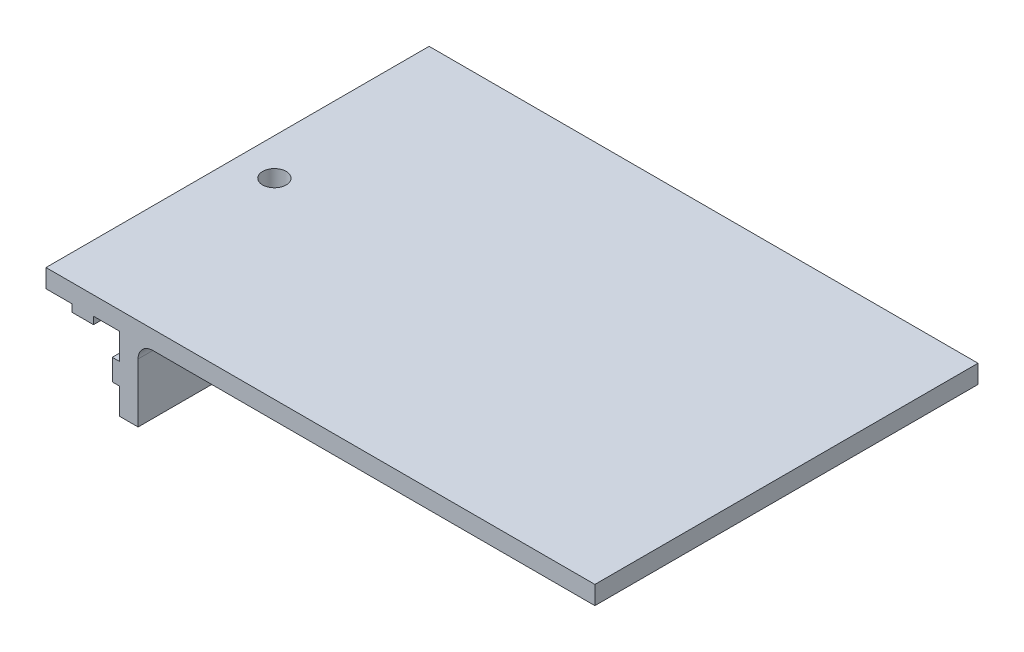
ISO-10303-21;
HEADER;
FILE_DESCRIPTION(('STEP AP214'),'2;1');
FILE_NAME('part.step','',(''),(''),'','','');
FILE_SCHEMA(('AUTOMOTIVE_DESIGN { 1 0 10303 214 1 1 1 1 }'));
ENDSEC;
DATA;
#1=APPLICATION_CONTEXT('core data for automotive mechanical design processes');
#2=APPLICATION_PROTOCOL_DEFINITION('international standard','automotive_design',2000,#1);
#3=PRODUCT_CONTEXT('',#1,'mechanical');
#4=PRODUCT('Part','Part','',(#3));
#5=PRODUCT_RELATED_PRODUCT_CATEGORY('part','',(#4));
#6=PRODUCT_DEFINITION_FORMATION('','',#4);
#7=PRODUCT_DEFINITION_CONTEXT('part definition',#1,'design');
#8=PRODUCT_DEFINITION('design','',#6,#7);
#9=PRODUCT_DEFINITION_SHAPE('','',#8);
#10=(LENGTH_UNIT() NAMED_UNIT(*) SI_UNIT(.MILLI.,.METRE.));
#11=(NAMED_UNIT(*) PLANE_ANGLE_UNIT() SI_UNIT($,.RADIAN.));
#12=(NAMED_UNIT(*) SI_UNIT($,.STERADIAN.) SOLID_ANGLE_UNIT());
#13=UNCERTAINTY_MEASURE_WITH_UNIT(LENGTH_MEASURE(1.E-05),#10,'distance_accuracy_value','');
#14=(GEOMETRIC_REPRESENTATION_CONTEXT(3) GLOBAL_UNCERTAINTY_ASSIGNED_CONTEXT((#13)) GLOBAL_UNIT_ASSIGNED_CONTEXT((#10,
#11,#12)) REPRESENTATION_CONTEXT('',''));
#15=CARTESIAN_POINT('',(0.,0.,0.));
#16=DIRECTION('',(0.,0.,1.));
#17=DIRECTION('',(1.,0.,0.));
#18=AXIS2_PLACEMENT_3D('',#15,#16,#17);
#19=CARTESIAN_POINT('',(-8.95,0.,26.));
#20=DIRECTION('',(1.,0.,0.));
#21=DIRECTION('',(0.,0.,-1.));
#22=AXIS2_PLACEMENT_3D('',#19,#20,#21);
#23=PLANE('',#22);
#24=DIRECTION('',(0.,0.,-1.));
#25=VECTOR('',#24,1.);
#26=CARTESIAN_POINT('',(-8.95,-1.00000000000001,26.));
#27=LINE('',#26,#25);
#28=CARTESIAN_POINT('',(-8.95,-1.00000000000001,-0.67638746292342));
#29=VERTEX_POINT('',#28);
#30=CARTESIAN_POINT('',(-8.95,-1.00000000000001,-26.));
#31=VERTEX_POINT('',#30);
#32=EDGE_CURVE('E225',#29,#31,#27,.T.);
#33=ORIENTED_EDGE('',*,*,#32,.F.);
#34=DIRECTION('',(0.,1.,0.));
#35=VECTOR('',#34,1.);
#36=CARTESIAN_POINT('',(-8.95,-10.,-0.676387462923418));
#37=LINE('',#36,#35);
#38=CARTESIAN_POINT('',(-8.95,0.,-0.676387462923418));
#39=VERTEX_POINT('',#38);
#40=EDGE_CURVE('E491',#29,#39,#37,.T.);
#41=ORIENTED_EDGE('',*,*,#40,.T.);
#42=DIRECTION('',(0.,0.,-1.));
#43=VECTOR('',#42,1.);
#44=CARTESIAN_POINT('',(-8.95,0.,26.));
#45=LINE('',#44,#43);
#46=CARTESIAN_POINT('',(-8.95,0.,-26.));
#47=VERTEX_POINT('',#46);
#48=EDGE_CURVE('E229',#39,#47,#45,.T.);
#49=ORIENTED_EDGE('',*,*,#48,.T.);
#50=DIRECTION('',(0.,-1.,0.));
#51=VECTOR('',#50,1.);
#52=CARTESIAN_POINT('',(-8.95,0.,-26.));
#53=LINE('',#52,#51);
#54=EDGE_CURVE('E368',#47,#31,#53,.T.);
#55=ORIENTED_EDGE('',*,*,#54,.T.);
#56=EDGE_LOOP('',(#33,#41,#49,#55));
#57=FACE_BOUND('',#56,.T.);
#58=ADVANCED_FACE('F33',(#57),#23,.F.);
#59=CARTESIAN_POINT('',(-8.95,-1.00000000000001,26.));
#60=DIRECTION('',(0.,1.,0.));
#61=DIRECTION('',(0.,0.,1.));
#62=AXIS2_PLACEMENT_3D('',#59,#60,#61);
#63=PLANE('',#62);
#64=DIRECTION('',(0.,0.,-1.));
#65=VECTOR('',#64,1.);
#66=CARTESIAN_POINT('',(-6.05,-1.00000000000001,26.));
#67=LINE('',#66,#65);
#68=CARTESIAN_POINT('',(-6.04999999999999,-1.00000000000001,-0.676387462923421));
#69=VERTEX_POINT('',#68);
#70=CARTESIAN_POINT('',(-6.05,-1.00000000000001,-26.));
#71=VERTEX_POINT('',#70);
#72=EDGE_CURVE('E217',#69,#71,#67,.T.);
#73=ORIENTED_EDGE('',*,*,#72,.F.);
#74=CARTESIAN_POINT('',(-7.5,-1.00000000000001,0.));
#75=DIRECTION('',(0.,1.,0.));
#76=DIRECTION('',(0.,0.,1.));
#77=AXIS2_PLACEMENT_3D('',#74,#75,#76);
#78=CIRCLE('',#77,1.6);
#79=EDGE_CURVE('E386',#69,#29,#78,.T.);
#80=ORIENTED_EDGE('',*,*,#79,.T.);
#81=ORIENTED_EDGE('',*,*,#32,.T.);
#82=DIRECTION('',(1.,0.,0.));
#83=VECTOR('',#82,1.);
#84=CARTESIAN_POINT('',(-8.95,-1.00000000000001,-26.));
#85=LINE('',#84,#83);
#86=EDGE_CURVE('E371',#31,#71,#85,.T.);
#87=ORIENTED_EDGE('',*,*,#86,.T.);
#88=EDGE_LOOP('',(#73,#80,#81,#87));
#89=FACE_BOUND('',#88,.T.);
#90=ADVANCED_FACE('F384',(#89),#63,.F.);
#91=CARTESIAN_POINT('',(-6.05,-1.00000000000001,26.));
#92=DIRECTION('',(-1.,0.,0.));
#93=DIRECTION('',(0.,-1.,0.));
#94=AXIS2_PLACEMENT_3D('',#91,#92,#93);
#95=PLANE('',#94);
#96=CARTESIAN_POINT('',(-6.05,-1.00000000000001,26.));
#97=VERTEX_POINT('',#96);
#98=CARTESIAN_POINT('',(-6.04999999999999,-1.00000000000001,0.676387462923421));
#99=VERTEX_POINT('',#98);
#100=EDGE_CURVE('E211',#97,#99,#67,.T.);
#101=ORIENTED_EDGE('',*,*,#100,.T.);
#102=DIRECTION('',(0.,1.,0.));
#103=VECTOR('',#102,1.);
#104=CARTESIAN_POINT('',(-6.04999999999999,-10.,0.676387462923421));
#105=LINE('',#104,#103);
#106=CARTESIAN_POINT('',(-6.05,0.,0.676387462923439));
#107=VERTEX_POINT('',#106);
#108=EDGE_CURVE('E198',#99,#107,#105,.T.);
#109=ORIENTED_EDGE('',*,*,#108,.T.);
#110=DIRECTION('',(0.,0.,-1.));
#111=VECTOR('',#110,1.);
#112=CARTESIAN_POINT('',(-6.05,0.,26.));
#113=LINE('',#112,#111);
#114=CARTESIAN_POINT('',(-6.05,0.,26.));
#115=VERTEX_POINT('',#114);
#116=EDGE_CURVE('E208',#115,#107,#113,.T.);
#117=ORIENTED_EDGE('',*,*,#116,.F.);
#118=DIRECTION('',(0.,1.,0.));
#119=VECTOR('',#118,1.);
#120=CARTESIAN_POINT('',(-6.05,-1.00000000000001,26.));
#121=LINE('',#120,#119);
#122=EDGE_CURVE('E422',#97,#115,#121,.T.);
#123=ORIENTED_EDGE('',*,*,#122,.F.);
#124=EDGE_LOOP('',(#101,#109,#117,#123));
#125=FACE_BOUND('',#124,.T.);
#126=ADVANCED_FACE('F206',(#125),#95,.F.);
#127=CARTESIAN_POINT('',(-2.5,-3.55000000000001,26.));
#128=DIRECTION('',(0.,-1.,0.));
#129=DIRECTION('',(0.,0.,-1.));
#130=AXIS2_PLACEMENT_3D('',#127,#128,#129);
#131=PLANE('',#130);
#132=DIRECTION('',(0.,0.,-1.));
#133=VECTOR('',#132,1.);
#134=CARTESIAN_POINT('',(-3.5,-3.55000000000001,26.));
#135=LINE('',#134,#133);
#136=CARTESIAN_POINT('',(-3.5,-3.55000000000001,-0.676387462923449));
#137=VERTEX_POINT('',#136);
#138=CARTESIAN_POINT('',(-3.5,-3.55000000000001,-26.));
#139=VERTEX_POINT('',#138);
#140=EDGE_CURVE('E300',#137,#139,#135,.T.);
#141=ORIENTED_EDGE('',*,*,#140,.F.);
#142=DIRECTION('',(1.,0.,0.));
#143=VECTOR('',#142,1.);
#144=CARTESIAN_POINT('',(-12.5,-3.55000000000001,-0.676387462923447));
#145=LINE('',#144,#143);
#146=CARTESIAN_POINT('',(-2.5,-3.55000000000001,-0.676387462923447));
#147=VERTEX_POINT('',#146);
#148=EDGE_CURVE('E321',#137,#147,#145,.T.);
#149=ORIENTED_EDGE('',*,*,#148,.T.);
#150=DIRECTION('',(0.,0.,-1.));
#151=VECTOR('',#150,1.);
#152=CARTESIAN_POINT('',(-2.5,-3.55000000000001,26.));
#153=LINE('',#152,#151);
#154=CARTESIAN_POINT('',(-2.5,-3.55000000000001,-26.));
#155=VERTEX_POINT('',#154);
#156=EDGE_CURVE('E303',#147,#155,#153,.T.);
#157=ORIENTED_EDGE('',*,*,#156,.T.);
#158=DIRECTION('',(-1.,0.,0.));
#159=VECTOR('',#158,1.);
#160=CARTESIAN_POINT('',(-2.5,-3.55000000000001,-26.));
#161=LINE('',#160,#159);
#162=EDGE_CURVE('E319',#155,#139,#161,.T.);
#163=ORIENTED_EDGE('',*,*,#162,.T.);
#164=EDGE_LOOP('',(#141,#149,#157,#163));
#165=FACE_BOUND('',#164,.T.);
#166=ADVANCED_FACE('F317',(#165),#131,.F.);
#167=CARTESIAN_POINT('',(-3.5,-3.55000000000001,26.));
#168=DIRECTION('',(1.,0.,0.));
#169=DIRECTION('',(0.,0.,-1.));
#170=AXIS2_PLACEMENT_3D('',#167,#168,#169);
#171=PLANE('',#170);
#172=CARTESIAN_POINT('',(-3.5,-3.55000000000001,26.));
#173=VERTEX_POINT('',#172);
#174=CARTESIAN_POINT('',(-3.5,-3.55000000000001,0.676387462923449));
#175=VERTEX_POINT('',#174);
#176=EDGE_CURVE('E301',#173,#175,#135,.T.);
#177=ORIENTED_EDGE('',*,*,#176,.T.);
#178=CARTESIAN_POINT('',(-3.5,-5.,0.));
#179=DIRECTION('',(1.,0.,0.));
#180=DIRECTION('',(0.,0.,-1.));
#181=AXIS2_PLACEMENT_3D('',#178,#179,#180);
#182=CIRCLE('',#181,1.6);
#183=CARTESIAN_POINT('',(-3.5,-6.44999999999999,0.676387462923449));
#184=VERTEX_POINT('',#183);
#185=EDGE_CURVE('E448',#175,#184,#182,.T.);
#186=ORIENTED_EDGE('',*,*,#185,.T.);
#187=DIRECTION('',(0.,0.,-1.));
#188=VECTOR('',#187,1.);
#189=CARTESIAN_POINT('',(-3.5,-6.45,26.));
#190=LINE('',#189,#188);
#191=CARTESIAN_POINT('',(-3.5,-6.45,26.));
#192=VERTEX_POINT('',#191);
#193=EDGE_CURVE('E297',#192,#184,#190,.T.);
#194=ORIENTED_EDGE('',*,*,#193,.F.);
#195=DIRECTION('',(0.,-1.,0.));
#196=VECTOR('',#195,1.);
#197=CARTESIAN_POINT('',(-3.5,-3.55000000000001,26.));
#198=LINE('',#197,#196);
#199=EDGE_CURVE('E429',#173,#192,#198,.T.);
#200=ORIENTED_EDGE('',*,*,#199,.F.);
#201=EDGE_LOOP('',(#177,#186,#194,#200));
#202=FACE_BOUND('',#201,.T.);
#203=ADVANCED_FACE('F460',(#202),#171,.F.);
#204=CARTESIAN_POINT('',(-3.5,-6.45,26.));
#205=DIRECTION('',(0.,1.,0.));
#206=DIRECTION('',(-1.,0.,0.));
#207=AXIS2_PLACEMENT_3D('',#204,#205,#206);
#208=PLANE('',#207);
#209=ORIENTED_EDGE('',*,*,#193,.T.);
#210=DIRECTION('',(1.,0.,0.));
#211=VECTOR('',#210,1.);
#212=CARTESIAN_POINT('',(-12.5,-6.44999999999999,0.676387462923449));
#213=LINE('',#212,#211);
#214=CARTESIAN_POINT('',(-2.5,-6.45,0.676387462923429));
#215=VERTEX_POINT('',#214);
#216=EDGE_CURVE('E437',#184,#215,#213,.T.);
#217=ORIENTED_EDGE('',*,*,#216,.T.);
#218=DIRECTION('',(0.,0.,-1.));
#219=VECTOR('',#218,1.);
#220=CARTESIAN_POINT('',(-2.5,-6.45,26.));
#221=LINE('',#220,#219);
#222=CARTESIAN_POINT('',(-2.5,-6.45,26.));
#223=VERTEX_POINT('',#222);
#224=EDGE_CURVE('E293',#223,#215,#221,.T.);
#225=ORIENTED_EDGE('',*,*,#224,.F.);
#226=DIRECTION('',(1.,0.,0.));
#227=VECTOR('',#226,1.);
#228=CARTESIAN_POINT('',(-3.5,-6.45,26.));
#229=LINE('',#228,#227);
#230=EDGE_CURVE('E353',#192,#223,#229,.T.);
#231=ORIENTED_EDGE('',*,*,#230,.F.);
#232=EDGE_LOOP('',(#209,#217,#225,#231));
#233=FACE_BOUND('',#232,.T.);
#234=ADVANCED_FACE('F436',(#233),#208,.F.);
#235=CARTESIAN_POINT('',(62.,0.,26.));
#236=DIRECTION('',(0.,1.,0.));
#237=DIRECTION('',(-1.,0.,0.));
#238=AXIS2_PLACEMENT_3D('',#235,#236,#237);
#239=PLANE('',#238);
#240=DIRECTION('',(1.,0.,0.));
#241=VECTOR('',#240,1.);
#242=CARTESIAN_POINT('',(62.,0.,26.));
#243=LINE('',#242,#241);
#244=CARTESIAN_POINT('',(2.,0.,26.));
#245=VERTEX_POINT('',#244);
#246=CARTESIAN_POINT('',(62.,0.,26.));
#247=VERTEX_POINT('',#246);
#248=EDGE_CURVE('E256',#245,#247,#243,.T.);
#249=ORIENTED_EDGE('',*,*,#248,.F.);
#250=DIRECTION('',(0.,0.,-1.));
#251=VECTOR('',#250,1.);
#252=CARTESIAN_POINT('',(2.,0.,-26.));
#253=LINE('',#252,#251);
#254=CARTESIAN_POINT('',(2.,0.,-26.));
#255=VERTEX_POINT('',#254);
#256=EDGE_CURVE('E245',#245,#255,#253,.T.);
#257=ORIENTED_EDGE('',*,*,#256,.T.);
#258=DIRECTION('',(1.,0.,0.));
#259=VECTOR('',#258,1.);
#260=CARTESIAN_POINT('',(62.,0.,-26.));
#261=LINE('',#260,#259);
#262=CARTESIAN_POINT('',(62.,0.,-26.));
#263=VERTEX_POINT('',#262);
#264=EDGE_CURVE('E276',#255,#263,#261,.T.);
#265=ORIENTED_EDGE('',*,*,#264,.T.);
#266=DIRECTION('',(0.,0.,-1.));
#267=VECTOR('',#266,1.);
#268=CARTESIAN_POINT('',(62.,0.,26.));
#269=LINE('',#268,#267);
#270=EDGE_CURVE('E242',#247,#263,#269,.T.);
#271=ORIENTED_EDGE('',*,*,#270,.F.);
#272=EDGE_LOOP('',(#249,#257,#265,#271));
#273=FACE_BOUND('',#272,.T.);
#274=ADVANCED_FACE('F265',(#273),#239,.F.);
#275=CARTESIAN_POINT('',(62.,0.,26.));
#276=DIRECTION('',(-1.,0.,0.));
#277=DIRECTION('',(0.,0.,1.));
#278=AXIS2_PLACEMENT_3D('',#275,#276,#277);
#279=PLANE('',#278);
#280=DIRECTION('',(0.,1.,0.));
#281=VECTOR('',#280,1.);
#282=CARTESIAN_POINT('',(62.,0.,-26.));
#283=LINE('',#282,#281);
#284=CARTESIAN_POINT('',(62.,2.5,-26.));
#285=VERTEX_POINT('',#284);
#286=EDGE_CURVE('E358',#263,#285,#283,.T.);
#287=ORIENTED_EDGE('',*,*,#286,.T.);
#288=DIRECTION('',(0.,0.,-1.));
#289=VECTOR('',#288,1.);
#290=CARTESIAN_POINT('',(62.,2.5,26.));
#291=LINE('',#290,#289);
#292=CARTESIAN_POINT('',(62.,2.5,26.));
#293=VERTEX_POINT('',#292);
#294=EDGE_CURVE('E239',#293,#285,#291,.T.);
#295=ORIENTED_EDGE('',*,*,#294,.F.);
#296=DIRECTION('',(0.,1.,0.));
#297=VECTOR('',#296,1.);
#298=CARTESIAN_POINT('',(62.,0.,26.));
#299=LINE('',#298,#297);
#300=EDGE_CURVE('E267',#247,#293,#299,.T.);
#301=ORIENTED_EDGE('',*,*,#300,.F.);
#302=ORIENTED_EDGE('',*,*,#270,.T.);
#303=EDGE_LOOP('',(#287,#295,#301,#302));
#304=FACE_BOUND('',#303,.T.);
#305=ADVANCED_FACE('F411',(#304),#279,.F.);
#306=CARTESIAN_POINT('',(62.,2.5,26.));
#307=DIRECTION('',(0.,-1.,0.));
#308=DIRECTION('',(1.,0.,0.));
#309=AXIS2_PLACEMENT_3D('',#306,#307,#308);
#310=PLANE('',#309);
#311=CARTESIAN_POINT('',(-7.5,2.49999999999999,0.));
#312=DIRECTION('',(0.,1.,0.));
#313=DIRECTION('',(-1.,0.,0.));
#314=AXIS2_PLACEMENT_3D('',#311,#312,#313);
#315=CIRCLE('',#314,1.6);
#316=CARTESIAN_POINT('',(-9.1,2.49999999999999,0.));
#317=VERTEX_POINT('',#316);
#318=EDGE_CURVE('E500',#317,#317,#315,.T.);
#319=ORIENTED_EDGE('',*,*,#318,.F.);
#320=EDGE_LOOP('',(#319));
#321=FACE_BOUND('',#320,.T.);
#322=DIRECTION('',(-1.,0.,0.));
#323=VECTOR('',#322,1.);
#324=CARTESIAN_POINT('',(62.,2.5,-26.));
#325=LINE('',#324,#323);
#326=CARTESIAN_POINT('',(-12.5,2.49999999999999,-26.));
#327=VERTEX_POINT('',#326);
#328=EDGE_CURVE('E361',#285,#327,#325,.T.);
#329=ORIENTED_EDGE('',*,*,#328,.T.);
#330=DIRECTION('',(0.,0.,-1.));
#331=VECTOR('',#330,1.);
#332=CARTESIAN_POINT('',(-12.5,2.49999999999999,26.));
#333=LINE('',#332,#331);
#334=CARTESIAN_POINT('',(-12.5,2.49999999999999,26.));
#335=VERTEX_POINT('',#334);
#336=EDGE_CURVE('E236',#335,#327,#333,.T.);
#337=ORIENTED_EDGE('',*,*,#336,.F.);
#338=DIRECTION('',(-1.,0.,0.));
#339=VECTOR('',#338,1.);
#340=CARTESIAN_POINT('',(62.,2.5,26.));
#341=LINE('',#340,#339);
#342=EDGE_CURVE('E408',#293,#335,#341,.T.);
#343=ORIENTED_EDGE('',*,*,#342,.F.);
#344=ORIENTED_EDGE('',*,*,#294,.T.);
#345=EDGE_LOOP('',(#329,#337,#343,#344));
#346=FACE_BOUND('',#345,.T.);
#347=ADVANCED_FACE('F407',(#321,#346),#310,.F.);
#348=CARTESIAN_POINT('',(-12.5,2.49999999999999,26.));
#349=DIRECTION('',(1.,0.,0.));
#350=DIRECTION('',(0.,1.,0.));
#351=AXIS2_PLACEMENT_3D('',#348,#349,#350);
#352=PLANE('',#351);
#353=DIRECTION('',(0.,-1.,0.));
#354=VECTOR('',#353,1.);
#355=CARTESIAN_POINT('',(-12.5,2.49999999999999,-26.));
#356=LINE('',#355,#354);
#357=CARTESIAN_POINT('',(-12.5,0.,-26.));
#358=VERTEX_POINT('',#357);
#359=EDGE_CURVE('E363',#327,#358,#356,.T.);
#360=ORIENTED_EDGE('',*,*,#359,.T.);
#361=DIRECTION('',(0.,0.,-1.));
#362=VECTOR('',#361,1.);
#363=CARTESIAN_POINT('',(-12.5,0.,26.));
#364=LINE('',#363,#362);
#365=CARTESIAN_POINT('',(-12.5,0.,26.));
#366=VERTEX_POINT('',#365);
#367=EDGE_CURVE('E233',#366,#358,#364,.T.);
#368=ORIENTED_EDGE('',*,*,#367,.F.);
#369=DIRECTION('',(0.,-1.,0.));
#370=VECTOR('',#369,1.);
#371=CARTESIAN_POINT('',(-12.5,2.49999999999999,26.));
#372=LINE('',#371,#370);
#373=EDGE_CURVE('E403',#335,#366,#372,.T.);
#374=ORIENTED_EDGE('',*,*,#373,.F.);
#375=ORIENTED_EDGE('',*,*,#336,.T.);
#376=EDGE_LOOP('',(#360,#368,#374,#375));
#377=FACE_BOUND('',#376,.T.);
#378=ADVANCED_FACE('F402',(#377),#352,.F.);
#379=CARTESIAN_POINT('',(-12.5,0.,26.));
#380=DIRECTION('',(0.,1.,0.));
#381=DIRECTION('',(0.,0.,1.));
#382=AXIS2_PLACEMENT_3D('',#379,#380,#381);
#383=PLANE('',#382);
#384=ORIENTED_EDGE('',*,*,#48,.F.);
#385=CARTESIAN_POINT('',(-7.5,0.,0.));
#386=DIRECTION('',(0.,1.,0.));
#387=DIRECTION('',(0.,0.,1.));
#388=AXIS2_PLACEMENT_3D('',#385,#386,#387);
#389=CIRCLE('',#388,1.6);
#390=CARTESIAN_POINT('',(-8.95,0.,0.676387462923418));
#391=VERTEX_POINT('',#390);
#392=EDGE_CURVE('E490',#39,#391,#389,.T.);
#393=ORIENTED_EDGE('',*,*,#392,.T.);
#394=CARTESIAN_POINT('',(-8.95,0.,26.));
#395=VERTEX_POINT('',#394);
#396=EDGE_CURVE('E230',#395,#391,#45,.T.);
#397=ORIENTED_EDGE('',*,*,#396,.F.);
#398=DIRECTION('',(1.,0.,0.));
#399=VECTOR('',#398,1.);
#400=CARTESIAN_POINT('',(-12.5,0.,26.));
#401=LINE('',#400,#399);
#402=EDGE_CURVE('E399',#366,#395,#401,.T.);
#403=ORIENTED_EDGE('',*,*,#402,.F.);
#404=ORIENTED_EDGE('',*,*,#367,.T.);
#405=DIRECTION('',(1.,0.,0.));
#406=VECTOR('',#405,1.);
#407=CARTESIAN_POINT('',(-12.5,0.,-26.));
#408=LINE('',#407,#406);
#409=EDGE_CURVE('E365',#358,#47,#408,.T.);
#410=ORIENTED_EDGE('',*,*,#409,.T.);
#411=EDGE_LOOP('',(#384,#393,#397,#403,#404,#410));
#412=FACE_BOUND('',#411,.T.);
#413=ADVANCED_FACE('F394',(#412),#383,.F.);
#414=ORIENTED_EDGE('',*,*,#396,.T.);
#415=DIRECTION('',(0.,1.,0.));
#416=VECTOR('',#415,1.);
#417=CARTESIAN_POINT('',(-8.95,-10.,0.676387462923418));
#418=LINE('',#417,#416);
#419=CARTESIAN_POINT('',(-8.95,-1.00000000000001,0.67638746292342));
#420=VERTEX_POINT('',#419);
#421=EDGE_CURVE('E489',#391,#420,#418,.F.);
#422=ORIENTED_EDGE('',*,*,#421,.T.);
#423=CARTESIAN_POINT('',(-8.95,-1.00000000000001,26.));
#424=VERTEX_POINT('',#423);
#425=EDGE_CURVE('E226',#424,#420,#27,.T.);
#426=ORIENTED_EDGE('',*,*,#425,.F.);
#427=DIRECTION('',(0.,-1.,0.));
#428=VECTOR('',#427,1.);
#429=CARTESIAN_POINT('',(-8.95,0.,26.));
#430=LINE('',#429,#428);
#431=EDGE_CURVE('E418',#395,#424,#430,.T.);
#432=ORIENTED_EDGE('',*,*,#431,.F.);
#433=EDGE_LOOP('',(#414,#422,#426,#432));
#434=FACE_BOUND('',#433,.T.);
#435=ADVANCED_FACE('F472',(#434),#23,.F.);
#436=ORIENTED_EDGE('',*,*,#425,.T.);
#437=EDGE_CURVE('E212',#420,#99,#78,.T.);
#438=ORIENTED_EDGE('',*,*,#437,.T.);
#439=ORIENTED_EDGE('',*,*,#100,.F.);
#440=DIRECTION('',(1.,0.,0.));
#441=VECTOR('',#440,1.);
#442=CARTESIAN_POINT('',(-8.95,-1.00000000000001,26.));
#443=LINE('',#442,#441);
#444=EDGE_CURVE('E420',#424,#97,#443,.T.);
#445=ORIENTED_EDGE('',*,*,#444,.F.);
#446=EDGE_LOOP('',(#436,#438,#439,#445));
#447=FACE_BOUND('',#446,.T.);
#448=ADVANCED_FACE('F477',(#447),#63,.F.);
#449=CARTESIAN_POINT('',(-6.05,0.,-0.676387462923439));
#450=VERTEX_POINT('',#449);
#451=CARTESIAN_POINT('',(-6.05,0.,-26.));
#452=VERTEX_POINT('',#451);
#453=EDGE_CURVE('E218',#450,#452,#113,.T.);
#454=ORIENTED_EDGE('',*,*,#453,.F.);
#455=DIRECTION('',(0.,1.,0.));
#456=VECTOR('',#455,1.);
#457=CARTESIAN_POINT('',(-6.04999999999999,-10.,-0.676387462923421));
#458=LINE('',#457,#456);
#459=EDGE_CURVE('E48',#450,#69,#458,.F.);
#460=ORIENTED_EDGE('',*,*,#459,.T.);
#461=ORIENTED_EDGE('',*,*,#72,.T.);
#462=DIRECTION('',(0.,1.,0.));
#463=VECTOR('',#462,1.);
#464=CARTESIAN_POINT('',(-6.05,-1.00000000000001,-26.));
#465=LINE('',#464,#463);
#466=EDGE_CURVE('E374',#71,#452,#465,.T.);
#467=ORIENTED_EDGE('',*,*,#466,.T.);
#468=EDGE_LOOP('',(#454,#460,#461,#467));
#469=FACE_BOUND('',#468,.T.);
#470=ADVANCED_FACE('F380',(#469),#95,.F.);
#471=CARTESIAN_POINT('',(-6.05,0.,26.));
#472=DIRECTION('',(0.,1.,0.));
#473=DIRECTION('',(0.,0.,1.));
#474=AXIS2_PLACEMENT_3D('',#471,#472,#473);
#475=PLANE('',#474);
#476=ORIENTED_EDGE('',*,*,#116,.T.);
#477=CARTESIAN_POINT('',(-7.5,0.,0.));
#478=DIRECTION('',(0.,1.,0.));
#479=DIRECTION('',(0.,0.,1.));
#480=AXIS2_PLACEMENT_3D('',#477,#478,#479);
#481=CIRCLE('',#480,1.6);
#482=EDGE_CURVE('E11',#107,#450,#481,.T.);
#483=ORIENTED_EDGE('',*,*,#482,.T.);
#484=ORIENTED_EDGE('',*,*,#453,.T.);
#485=DIRECTION('',(1.,0.,0.));
#486=VECTOR('',#485,1.);
#487=CARTESIAN_POINT('',(-6.05,0.,-26.));
#488=LINE('',#487,#486);
#489=CARTESIAN_POINT('',(-2.5,0.,-26.));
#490=VERTEX_POINT('',#489);
#491=EDGE_CURVE('E329',#452,#490,#488,.T.);
#492=ORIENTED_EDGE('',*,*,#491,.T.);
#493=DIRECTION('',(0.,0.,-1.));
#494=VECTOR('',#493,1.);
#495=CARTESIAN_POINT('',(-2.5,0.,26.));
#496=LINE('',#495,#494);
#497=CARTESIAN_POINT('',(-2.5,0.,26.));
#498=VERTEX_POINT('',#497);
#499=EDGE_CURVE('E221',#498,#490,#496,.T.);
#500=ORIENTED_EDGE('',*,*,#499,.F.);
#501=DIRECTION('',(1.,0.,0.));
#502=VECTOR('',#501,1.);
#503=CARTESIAN_POINT('',(-6.05,0.,26.));
#504=LINE('',#503,#502);
#505=EDGE_CURVE('E216',#115,#498,#504,.T.);
#506=ORIENTED_EDGE('',*,*,#505,.F.);
#507=EDGE_LOOP('',(#476,#483,#484,#492,#500,#506));
#508=FACE_BOUND('',#507,.T.);
#509=ADVANCED_FACE('F214',(#508),#475,.F.);
#510=CARTESIAN_POINT('',(-2.5,0.,26.));
#511=DIRECTION('',(1.,0.,0.));
#512=DIRECTION('',(0.,1.,0.));
#513=AXIS2_PLACEMENT_3D('',#510,#511,#512);
#514=PLANE('',#513);
#515=ORIENTED_EDGE('',*,*,#156,.F.);
#516=CARTESIAN_POINT('',(-2.5,-5.,0.));
#517=DIRECTION('',(1.,0.,0.));
#518=DIRECTION('',(0.,1.,0.));
#519=AXIS2_PLACEMENT_3D('',#516,#517,#518);
#520=CIRCLE('',#519,1.6);
#521=CARTESIAN_POINT('',(-2.5,-3.55000000000001,0.676387462923447));
#522=VERTEX_POINT('',#521);
#523=EDGE_CURVE('E359',#147,#522,#520,.T.);
#524=ORIENTED_EDGE('',*,*,#523,.T.);
#525=CARTESIAN_POINT('',(-2.5,-3.55000000000001,26.));
#526=VERTEX_POINT('',#525);
#527=EDGE_CURVE('E304',#526,#522,#153,.T.);
#528=ORIENTED_EDGE('',*,*,#527,.F.);
#529=DIRECTION('',(0.,-1.,0.));
#530=VECTOR('',#529,1.);
#531=CARTESIAN_POINT('',(-2.5,0.,26.));
#532=LINE('',#531,#530);
#533=EDGE_CURVE('E425',#498,#526,#532,.T.);
#534=ORIENTED_EDGE('',*,*,#533,.F.);
#535=ORIENTED_EDGE('',*,*,#499,.T.);
#536=DIRECTION('',(0.,-1.,0.));
#537=VECTOR('',#536,1.);
#538=CARTESIAN_POINT('',(-2.5,0.,-26.));
#539=LINE('',#538,#537);
#540=EDGE_CURVE('E325',#490,#155,#539,.T.);
#541=ORIENTED_EDGE('',*,*,#540,.T.);
#542=EDGE_LOOP('',(#515,#524,#528,#534,#535,#541));
#543=FACE_BOUND('',#542,.T.);
#544=ADVANCED_FACE('F326',(#543),#514,.F.);
#545=ORIENTED_EDGE('',*,*,#527,.T.);
#546=DIRECTION('',(1.,0.,0.));
#547=VECTOR('',#546,1.);
#548=CARTESIAN_POINT('',(-12.5,-3.55000000000001,0.676387462923447));
#549=LINE('',#548,#547);
#550=EDGE_CURVE('E451',#522,#175,#549,.F.);
#551=ORIENTED_EDGE('',*,*,#550,.T.);
#552=ORIENTED_EDGE('',*,*,#176,.F.);
#553=DIRECTION('',(-1.,0.,0.));
#554=VECTOR('',#553,1.);
#555=CARTESIAN_POINT('',(-2.5,-3.55000000000001,26.));
#556=LINE('',#555,#554);
#557=EDGE_CURVE('E427',#526,#173,#556,.T.);
#558=ORIENTED_EDGE('',*,*,#557,.F.);
#559=EDGE_LOOP('',(#545,#551,#552,#558));
#560=FACE_BOUND('',#559,.T.);
#561=ADVANCED_FACE('F458',(#560),#131,.F.);
#562=CARTESIAN_POINT('',(-3.5,-6.44999999999999,-0.676387462923449));
#563=VERTEX_POINT('',#562);
#564=CARTESIAN_POINT('',(-3.5,-6.45,-26.));
#565=VERTEX_POINT('',#564);
#566=EDGE_CURVE('E296',#563,#565,#190,.T.);
#567=ORIENTED_EDGE('',*,*,#566,.F.);
#568=EDGE_CURVE('E447',#563,#137,#182,.T.);
#569=ORIENTED_EDGE('',*,*,#568,.T.);
#570=ORIENTED_EDGE('',*,*,#140,.T.);
#571=DIRECTION('',(0.,-1.,0.));
#572=VECTOR('',#571,1.);
#573=CARTESIAN_POINT('',(-3.5,-3.55000000000001,-26.));
#574=LINE('',#573,#572);
#575=EDGE_CURVE('E333',#139,#565,#574,.T.);
#576=ORIENTED_EDGE('',*,*,#575,.T.);
#577=EDGE_LOOP('',(#567,#569,#570,#576));
#578=FACE_BOUND('',#577,.T.);
#579=ADVANCED_FACE('F446',(#578),#171,.F.);
#580=CARTESIAN_POINT('',(-2.5,-6.45,-0.676387462923429));
#581=VERTEX_POINT('',#580);
#582=CARTESIAN_POINT('',(-2.5,-6.45,-26.));
#583=VERTEX_POINT('',#582);
#584=EDGE_CURVE('E292',#581,#583,#221,.T.);
#585=ORIENTED_EDGE('',*,*,#584,.F.);
#586=DIRECTION('',(1.,0.,0.));
#587=VECTOR('',#586,1.);
#588=CARTESIAN_POINT('',(-12.5,-6.44999999999999,-0.676387462923449));
#589=LINE('',#588,#587);
#590=EDGE_CURVE('E55',#581,#563,#589,.F.);
#591=ORIENTED_EDGE('',*,*,#590,.T.);
#592=ORIENTED_EDGE('',*,*,#566,.T.);
#593=DIRECTION('',(1.,0.,0.));
#594=VECTOR('',#593,1.);
#595=CARTESIAN_POINT('',(-3.5,-6.45,-26.));
#596=LINE('',#595,#594);
#597=EDGE_CURVE('E335',#565,#583,#596,.T.);
#598=ORIENTED_EDGE('',*,*,#597,.T.);
#599=EDGE_LOOP('',(#585,#591,#592,#598));
#600=FACE_BOUND('',#599,.T.);
#601=ADVANCED_FACE('F442',(#600),#208,.F.);
#602=CARTESIAN_POINT('',(-2.5,-6.45,26.));
#603=DIRECTION('',(1.,0.,0.));
#604=DIRECTION('',(0.,0.,-1.));
#605=AXIS2_PLACEMENT_3D('',#602,#603,#604);
#606=PLANE('',#605);
#607=ORIENTED_EDGE('',*,*,#224,.T.);
#608=CARTESIAN_POINT('',(-2.5,-5.,0.));
#609=DIRECTION('',(1.,0.,0.));
#610=DIRECTION('',(0.,0.,-1.));
#611=AXIS2_PLACEMENT_3D('',#608,#609,#610);
#612=CIRCLE('',#611,1.6);
#613=EDGE_CURVE('E438',#215,#581,#612,.T.);
#614=ORIENTED_EDGE('',*,*,#613,.T.);
#615=ORIENTED_EDGE('',*,*,#584,.T.);
#616=DIRECTION('',(0.,-1.,0.));
#617=VECTOR('',#616,1.);
#618=CARTESIAN_POINT('',(-2.5,-6.45,-26.));
#619=LINE('',#618,#617);
#620=CARTESIAN_POINT('',(-2.5,-10.,-26.));
#621=VERTEX_POINT('',#620);
#622=EDGE_CURVE('E284',#583,#621,#619,.T.);
#623=ORIENTED_EDGE('',*,*,#622,.T.);
#624=DIRECTION('',(0.,0.,-1.));
#625=VECTOR('',#624,1.);
#626=CARTESIAN_POINT('',(-2.5,-10.,26.));
#627=LINE('',#626,#625);
#628=CARTESIAN_POINT('',(-2.5,-10.,26.));
#629=VERTEX_POINT('',#628);
#630=EDGE_CURVE('E289',#629,#621,#627,.T.);
#631=ORIENTED_EDGE('',*,*,#630,.F.);
#632=DIRECTION('',(0.,-1.,0.));
#633=VECTOR('',#632,1.);
#634=CARTESIAN_POINT('',(-2.5,-6.45,26.));
#635=LINE('',#634,#633);
#636=EDGE_CURVE('E350',#223,#629,#635,.T.);
#637=ORIENTED_EDGE('',*,*,#636,.F.);
#638=EDGE_LOOP('',(#607,#614,#615,#623,#631,#637));
#639=FACE_BOUND('',#638,.T.);
#640=ADVANCED_FACE('F343',(#639),#606,.F.);
#641=CARTESIAN_POINT('',(-2.5,-10.,26.));
#642=DIRECTION('',(0.,1.,0.));
#643=DIRECTION('',(0.,0.,1.));
#644=AXIS2_PLACEMENT_3D('',#641,#642,#643);
#645=PLANE('',#644);
#646=DIRECTION('',(1.,0.,0.));
#647=VECTOR('',#646,1.);
#648=CARTESIAN_POINT('',(-2.5,-10.,-26.));
#649=LINE('',#648,#647);
#650=CARTESIAN_POINT('',(0.,-10.,-26.));
#651=VERTEX_POINT('',#650);
#652=EDGE_CURVE('E282',#621,#651,#649,.T.);
#653=ORIENTED_EDGE('',*,*,#652,.T.);
#654=DIRECTION('',(0.,0.,-1.));
#655=VECTOR('',#654,1.);
#656=CARTESIAN_POINT('',(0.,-10.,26.));
#657=LINE('',#656,#655);
#658=CARTESIAN_POINT('',(0.,-10.,26.));
#659=VERTEX_POINT('',#658);
#660=EDGE_CURVE('E281',#659,#651,#657,.T.);
#661=ORIENTED_EDGE('',*,*,#660,.F.);
#662=DIRECTION('',(1.,0.,0.));
#663=VECTOR('',#662,1.);
#664=CARTESIAN_POINT('',(-2.5,-10.,26.));
#665=LINE('',#664,#663);
#666=EDGE_CURVE('E349',#629,#659,#665,.T.);
#667=ORIENTED_EDGE('',*,*,#666,.F.);
#668=ORIENTED_EDGE('',*,*,#630,.T.);
#669=EDGE_LOOP('',(#653,#661,#667,#668));
#670=FACE_BOUND('',#669,.T.);
#671=ADVANCED_FACE('F348',(#670),#645,.F.);
#672=CARTESIAN_POINT('',(0.,0.,26.));
#673=DIRECTION('',(-1.,0.,0.));
#674=DIRECTION('',(0.,-1.,0.));
#675=AXIS2_PLACEMENT_3D('',#672,#673,#674);
#676=PLANE('',#675);
#677=CARTESIAN_POINT('',(0.,-5.,0.));
#678=DIRECTION('',(1.,0.,0.));
#679=DIRECTION('',(0.,1.,0.));
#680=AXIS2_PLACEMENT_3D('',#677,#678,#679);
#681=CIRCLE('',#680,1.6);
#682=CARTESIAN_POINT('',(0.,-3.4,0.));
#683=VERTEX_POINT('',#682);
#684=EDGE_CURVE('E439',#683,#683,#681,.T.);
#685=ORIENTED_EDGE('',*,*,#684,.F.);
#686=EDGE_LOOP('',(#685));
#687=FACE_BOUND('',#686,.T.);
#688=DIRECTION('',(0.,1.,0.));
#689=VECTOR('',#688,1.);
#690=CARTESIAN_POINT('',(0.,0.,-26.));
#691=LINE('',#690,#689);
#692=CARTESIAN_POINT('',(0.,-2.,-26.));
#693=VERTEX_POINT('',#692);
#694=EDGE_CURVE('E268',#651,#693,#691,.T.);
#695=ORIENTED_EDGE('',*,*,#694,.T.);
#696=DIRECTION('',(0.,0.,-1.));
#697=VECTOR('',#696,1.);
#698=CARTESIAN_POINT('',(0.,-2.,26.));
#699=LINE('',#698,#697);
#700=CARTESIAN_POINT('',(0.,-2.,26.));
#701=VERTEX_POINT('',#700);
#702=EDGE_CURVE('E248',#693,#701,#699,.F.);
#703=ORIENTED_EDGE('',*,*,#702,.T.);
#704=DIRECTION('',(0.,1.,0.));
#705=VECTOR('',#704,1.);
#706=CARTESIAN_POINT('',(0.,0.,26.));
#707=LINE('',#706,#705);
#708=EDGE_CURVE('E259',#659,#701,#707,.T.);
#709=ORIENTED_EDGE('',*,*,#708,.F.);
#710=ORIENTED_EDGE('',*,*,#660,.T.);
#711=EDGE_LOOP('',(#695,#703,#709,#710));
#712=FACE_BOUND('',#711,.T.);
#713=ADVANCED_FACE('F279',(#687,#712),#676,.F.);
#714=CARTESIAN_POINT('',(0.,0.,26.));
#715=DIRECTION('',(0.,0.,1.));
#716=DIRECTION('',(1.,0.,0.));
#717=AXIS2_PLACEMENT_3D('',#714,#715,#716);
#718=PLANE('',#717);
#719=ORIENTED_EDGE('',*,*,#708,.T.);
#720=CARTESIAN_POINT('',(2.,-2.,26.));
#721=DIRECTION('',(0.,0.,1.));
#722=DIRECTION('',(1.,0.,0.));
#723=AXIS2_PLACEMENT_3D('',#720,#721,#722);
#724=CIRCLE('',#723,2.);
#725=EDGE_CURVE('E41',#701,#245,#724,.F.);
#726=ORIENTED_EDGE('',*,*,#725,.T.);
#727=ORIENTED_EDGE('',*,*,#248,.T.);
#728=ORIENTED_EDGE('',*,*,#300,.T.);
#729=ORIENTED_EDGE('',*,*,#342,.T.);
#730=ORIENTED_EDGE('',*,*,#373,.T.);
#731=ORIENTED_EDGE('',*,*,#402,.T.);
#732=ORIENTED_EDGE('',*,*,#431,.T.);
#733=ORIENTED_EDGE('',*,*,#444,.T.);
#734=ORIENTED_EDGE('',*,*,#122,.T.);
#735=ORIENTED_EDGE('',*,*,#505,.T.);
#736=ORIENTED_EDGE('',*,*,#533,.T.);
#737=ORIENTED_EDGE('',*,*,#557,.T.);
#738=ORIENTED_EDGE('',*,*,#199,.T.);
#739=ORIENTED_EDGE('',*,*,#230,.T.);
#740=ORIENTED_EDGE('',*,*,#636,.T.);
#741=ORIENTED_EDGE('',*,*,#666,.T.);
#742=EDGE_LOOP('',(#719,#726,#727,#728,#729,#730,#731,#732,#733,#734,#735,#736,#737,#738,#739,
#740,#741));
#743=FACE_BOUND('',#742,.T.);
#744=ADVANCED_FACE('F255',(#743),#718,.T.);
#745=CARTESIAN_POINT('',(0.,0.,-26.));
#746=DIRECTION('',(0.,0.,1.));
#747=DIRECTION('',(1.,0.,0.));
#748=AXIS2_PLACEMENT_3D('',#745,#746,#747);
#749=PLANE('',#748);
#750=ORIENTED_EDGE('',*,*,#264,.F.);
#751=CARTESIAN_POINT('',(2.,-2.,-26.));
#752=DIRECTION('',(0.,0.,1.));
#753=DIRECTION('',(1.,0.,0.));
#754=AXIS2_PLACEMENT_3D('',#751,#752,#753);
#755=CIRCLE('',#754,2.);
#756=EDGE_CURVE('E250',#255,#693,#755,.T.);
#757=ORIENTED_EDGE('',*,*,#756,.T.);
#758=ORIENTED_EDGE('',*,*,#694,.F.);
#759=ORIENTED_EDGE('',*,*,#652,.F.);
#760=ORIENTED_EDGE('',*,*,#622,.F.);
#761=ORIENTED_EDGE('',*,*,#597,.F.);
#762=ORIENTED_EDGE('',*,*,#575,.F.);
#763=ORIENTED_EDGE('',*,*,#162,.F.);
#764=ORIENTED_EDGE('',*,*,#540,.F.);
#765=ORIENTED_EDGE('',*,*,#491,.F.);
#766=ORIENTED_EDGE('',*,*,#466,.F.);
#767=ORIENTED_EDGE('',*,*,#86,.F.);
#768=ORIENTED_EDGE('',*,*,#54,.F.);
#769=ORIENTED_EDGE('',*,*,#409,.F.);
#770=ORIENTED_EDGE('',*,*,#359,.F.);
#771=ORIENTED_EDGE('',*,*,#328,.F.);
#772=ORIENTED_EDGE('',*,*,#286,.F.);
#773=EDGE_LOOP('',(#750,#757,#758,#759,#760,#761,#762,#763,#764,#765,#766,#767,#768,#769,#770,
#771,#772));
#774=FACE_BOUND('',#773,.T.);
#775=ADVANCED_FACE('F273',(#774),#749,.F.);
#776=CARTESIAN_POINT('',(2.,-2.,26.));
#777=DIRECTION('',(0.,0.,1.));
#778=DIRECTION('',(1.,0.,0.));
#779=AXIS2_PLACEMENT_3D('',#776,#777,#778);
#780=CYLINDRICAL_SURFACE('',#779,2.);
#781=ORIENTED_EDGE('',*,*,#725,.F.);
#782=ORIENTED_EDGE('',*,*,#702,.F.);
#783=ORIENTED_EDGE('',*,*,#756,.F.);
#784=ORIENTED_EDGE('',*,*,#256,.F.);
#785=EDGE_LOOP('',(#781,#782,#783,#784));
#786=FACE_BOUND('',#785,.T.);
#787=ADVANCED_FACE('F35',(#786),#780,.F.);
#788=CARTESIAN_POINT('',(-12.5,-5.,0.));
#789=DIRECTION('',(1.,0.,0.));
#790=DIRECTION('',(0.,1.,0.));
#791=AXIS2_PLACEMENT_3D('',#788,#789,#790);
#792=CYLINDRICAL_SURFACE('',#791,1.6);
#793=ORIENTED_EDGE('',*,*,#684,.T.);
#794=EDGE_LOOP('',(#793));
#795=FACE_BOUND('',#794,.T.);
#796=ORIENTED_EDGE('',*,*,#148,.F.);
#797=ORIENTED_EDGE('',*,*,#568,.F.);
#798=ORIENTED_EDGE('',*,*,#590,.F.);
#799=ORIENTED_EDGE('',*,*,#613,.F.);
#800=ORIENTED_EDGE('',*,*,#216,.F.);
#801=ORIENTED_EDGE('',*,*,#185,.F.);
#802=ORIENTED_EDGE('',*,*,#550,.F.);
#803=ORIENTED_EDGE('',*,*,#523,.F.);
#804=EDGE_LOOP('',(#796,#797,#798,#799,#800,#801,#802,#803));
#805=FACE_BOUND('',#804,.T.);
#806=ADVANCED_FACE('F456',(#795,#805),#792,.F.);
#807=CARTESIAN_POINT('',(-7.5,-10.,0.));
#808=DIRECTION('',(0.,1.,0.));
#809=DIRECTION('',(-1.,0.,0.));
#810=AXIS2_PLACEMENT_3D('',#807,#808,#809);
#811=CYLINDRICAL_SURFACE('',#810,1.6);
#812=ORIENTED_EDGE('',*,*,#318,.T.);
#813=EDGE_LOOP('',(#812));
#814=FACE_BOUND('',#813,.T.);
#815=ORIENTED_EDGE('',*,*,#40,.F.);
#816=ORIENTED_EDGE('',*,*,#79,.F.);
#817=ORIENTED_EDGE('',*,*,#459,.F.);
#818=ORIENTED_EDGE('',*,*,#482,.F.);
#819=ORIENTED_EDGE('',*,*,#108,.F.);
#820=ORIENTED_EDGE('',*,*,#437,.F.);
#821=ORIENTED_EDGE('',*,*,#421,.F.);
#822=ORIENTED_EDGE('',*,*,#392,.F.);
#823=EDGE_LOOP('',(#815,#816,#817,#818,#819,#820,#821,#822));
#824=FACE_BOUND('',#823,.T.);
#825=ADVANCED_FACE('F197',(#814,#824),#811,.F.);
#826=CLOSED_SHELL('',(#58,#90,#126,#166,#203,#234,#274,#305,#347,#378,#413,#435,#448,#470,#509,
#544,#561,#579,#601,#640,#671,#713,#744,#775,#787,#806,#825));
#827=MANIFOLD_SOLID_BREP('B2',#826);
#828=ADVANCED_BREP_SHAPE_REPRESENTATION('',(#18,#827),#14);
#829=SHAPE_DEFINITION_REPRESENTATION(#9,#828);
ENDSEC;
END-ISO-10303-21;
